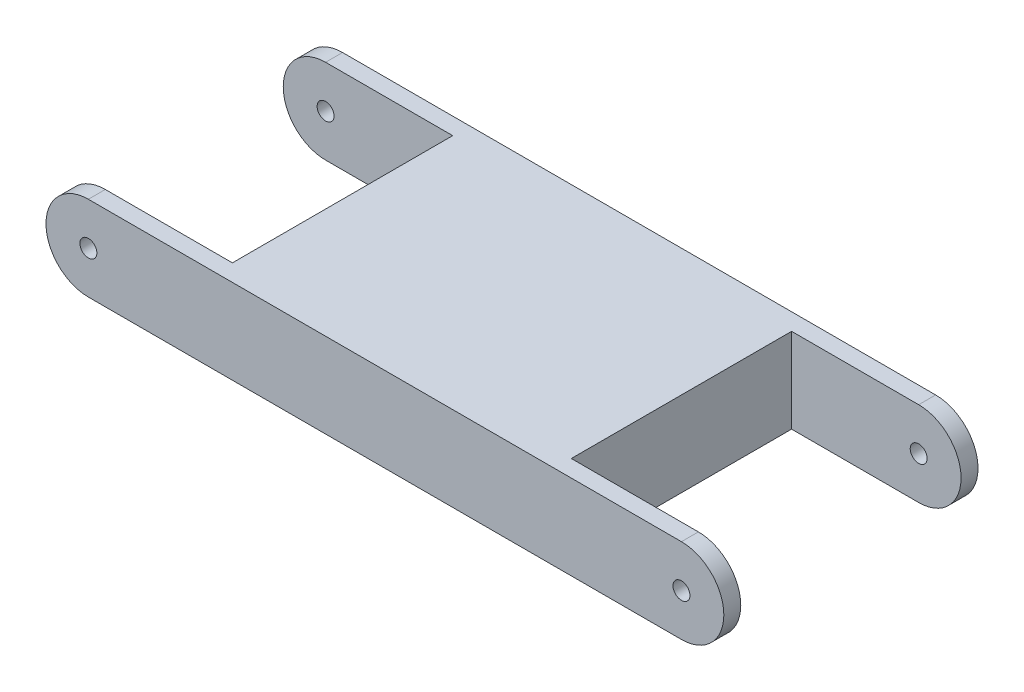
ISO-10303-21;
HEADER;
FILE_DESCRIPTION(('STEP AP214'),'2;1');
FILE_NAME('part.step','',(''),(''),'','','');
FILE_SCHEMA(('AUTOMOTIVE_DESIGN { 1 0 10303 214 1 1 1 1 }'));
ENDSEC;
DATA;
#1=APPLICATION_CONTEXT('core data for automotive mechanical design processes');
#2=APPLICATION_PROTOCOL_DEFINITION('international standard','automotive_design',2000,#1);
#3=PRODUCT_CONTEXT('',#1,'mechanical');
#4=PRODUCT('Part','Part','',(#3));
#5=PRODUCT_RELATED_PRODUCT_CATEGORY('part','',(#4));
#6=PRODUCT_DEFINITION_FORMATION('','',#4);
#7=PRODUCT_DEFINITION_CONTEXT('part definition',#1,'design');
#8=PRODUCT_DEFINITION('design','',#6,#7);
#9=PRODUCT_DEFINITION_SHAPE('','',#8);
#10=(LENGTH_UNIT() NAMED_UNIT(*) SI_UNIT(.MILLI.,.METRE.));
#11=(NAMED_UNIT(*) PLANE_ANGLE_UNIT() SI_UNIT($,.RADIAN.));
#12=(NAMED_UNIT(*) SI_UNIT($,.STERADIAN.) SOLID_ANGLE_UNIT());
#13=UNCERTAINTY_MEASURE_WITH_UNIT(LENGTH_MEASURE(1.E-05),#10,'distance_accuracy_value','');
#14=(GEOMETRIC_REPRESENTATION_CONTEXT(3) GLOBAL_UNCERTAINTY_ASSIGNED_CONTEXT((#13)) GLOBAL_UNIT_ASSIGNED_CONTEXT((#10,
#11,#12)) REPRESENTATION_CONTEXT('',''));
#15=CARTESIAN_POINT('',(0.,0.,0.));
#16=DIRECTION('',(0.,0.,1.));
#17=DIRECTION('',(1.,0.,0.));
#18=AXIS2_PLACEMENT_3D('',#15,#16,#17);
#19=CARTESIAN_POINT('',(-35.,-5.,30.));
#20=DIRECTION('',(0.,1.,0.));
#21=DIRECTION('',(0.,0.,1.));
#22=AXIS2_PLACEMENT_3D('',#19,#20,#21);
#23=PLANE('',#22);
#24=DIRECTION('',(1.,0.,0.));
#25=VECTOR('',#24,1.);
#26=CARTESIAN_POINT('',(-35.,-5.,2.));
#27=LINE('',#26,#25);
#28=CARTESIAN_POINT('',(20.,-5.,2.));
#29=VERTEX_POINT('',#28);
#30=CARTESIAN_POINT('',(35.,-5.,2.));
#31=VERTEX_POINT('',#30);
#32=EDGE_CURVE('E154',#29,#31,#27,.T.);
#33=ORIENTED_EDGE('',*,*,#32,.F.);
#34=DIRECTION('',(0.,0.,-1.));
#35=VECTOR('',#34,1.);
#36=CARTESIAN_POINT('',(20.,-5.,30.));
#37=LINE('',#36,#35);
#38=CARTESIAN_POINT('',(20.,-5.,28.));
#39=VERTEX_POINT('',#38);
#40=EDGE_CURVE('E156',#39,#29,#37,.T.);
#41=ORIENTED_EDGE('',*,*,#40,.F.);
#42=DIRECTION('',(-1.,0.,0.));
#43=VECTOR('',#42,1.);
#44=CARTESIAN_POINT('',(-35.,-5.,28.));
#45=LINE('',#44,#43);
#46=CARTESIAN_POINT('',(35.,-5.,28.));
#47=VERTEX_POINT('',#46);
#48=EDGE_CURVE('E138',#47,#39,#45,.T.);
#49=ORIENTED_EDGE('',*,*,#48,.F.);
#50=DIRECTION('',(0.,0.,-1.));
#51=VECTOR('',#50,1.);
#52=CARTESIAN_POINT('',(35.,-5.,30.));
#53=LINE('',#52,#51);
#54=CARTESIAN_POINT('',(35.,-5.,30.));
#55=VERTEX_POINT('',#54);
#56=EDGE_CURVE('E214',#55,#47,#53,.T.);
#57=ORIENTED_EDGE('',*,*,#56,.F.);
#58=DIRECTION('',(1.,0.,0.));
#59=VECTOR('',#58,1.);
#60=CARTESIAN_POINT('',(-35.,-5.,30.));
#61=LINE('',#60,#59);
#62=CARTESIAN_POINT('',(-35.,-5.,30.));
#63=VERTEX_POINT('',#62);
#64=EDGE_CURVE('E189',#63,#55,#61,.T.);
#65=ORIENTED_EDGE('',*,*,#64,.F.);
#66=DIRECTION('',(0.,0.,-1.));
#67=VECTOR('',#66,1.);
#68=CARTESIAN_POINT('',(-35.,-5.,30.));
#69=LINE('',#68,#67);
#70=CARTESIAN_POINT('',(-35.,-5.,28.));
#71=VERTEX_POINT('',#70);
#72=EDGE_CURVE('E217',#63,#71,#69,.T.);
#73=ORIENTED_EDGE('',*,*,#72,.T.);
#74=DIRECTION('',(-1.,0.,0.));
#75=VECTOR('',#74,1.);
#76=CARTESIAN_POINT('',(-35.,-5.,28.));
#77=LINE('',#76,#75);
#78=CARTESIAN_POINT('',(-20.,-5.,28.));
#79=VERTEX_POINT('',#78);
#80=EDGE_CURVE('E174',#79,#71,#77,.T.);
#81=ORIENTED_EDGE('',*,*,#80,.F.);
#82=DIRECTION('',(0.,0.,1.));
#83=VECTOR('',#82,1.);
#84=CARTESIAN_POINT('',(-20.,-5.,30.));
#85=LINE('',#84,#83);
#86=CARTESIAN_POINT('',(-20.,-5.,2.));
#87=VERTEX_POINT('',#86);
#88=EDGE_CURVE('E176',#87,#79,#85,.T.);
#89=ORIENTED_EDGE('',*,*,#88,.F.);
#90=DIRECTION('',(1.,0.,0.));
#91=VECTOR('',#90,1.);
#92=CARTESIAN_POINT('',(-35.,-5.,2.));
#93=LINE('',#92,#91);
#94=CARTESIAN_POINT('',(-35.,-5.,2.));
#95=VERTEX_POINT('',#94);
#96=EDGE_CURVE('E167',#95,#87,#93,.T.);
#97=ORIENTED_EDGE('',*,*,#96,.F.);
#98=CARTESIAN_POINT('',(-35.,-5.,0.));
#99=VERTEX_POINT('',#98);
#100=EDGE_CURVE('E216',#95,#99,#69,.T.);
#101=ORIENTED_EDGE('',*,*,#100,.T.);
#102=DIRECTION('',(1.,0.,0.));
#103=VECTOR('',#102,1.);
#104=CARTESIAN_POINT('',(-35.,-5.,0.));
#105=LINE('',#104,#103);
#106=CARTESIAN_POINT('',(35.,-5.,0.));
#107=VERTEX_POINT('',#106);
#108=EDGE_CURVE('E200',#99,#107,#105,.T.);
#109=ORIENTED_EDGE('',*,*,#108,.T.);
#110=EDGE_CURVE('E213',#31,#107,#53,.T.);
#111=ORIENTED_EDGE('',*,*,#110,.F.);
#112=EDGE_LOOP('',(#33,#41,#49,#57,#65,#73,#81,#89,#97,#101,#109,#111));
#113=FACE_BOUND('',#112,.T.);
#114=ADVANCED_FACE('F33',(#113),#23,.F.);
#115=CARTESIAN_POINT('',(-35.,5.,30.));
#116=DIRECTION('',(0.,-1.,0.));
#117=DIRECTION('',(0.,0.,-1.));
#118=AXIS2_PLACEMENT_3D('',#115,#116,#117);
#119=PLANE('',#118);
#120=DIRECTION('',(-1.,0.,0.));
#121=VECTOR('',#120,1.);
#122=CARTESIAN_POINT('',(-35.,5.,2.));
#123=LINE('',#122,#121);
#124=CARTESIAN_POINT('',(35.,5.,2.));
#125=VERTEX_POINT('',#124);
#126=CARTESIAN_POINT('',(20.,5.,2.));
#127=VERTEX_POINT('',#126);
#128=EDGE_CURVE('E152',#125,#127,#123,.T.);
#129=ORIENTED_EDGE('',*,*,#128,.F.);
#130=DIRECTION('',(0.,0.,-1.));
#131=VECTOR('',#130,1.);
#132=CARTESIAN_POINT('',(35.,5.,30.));
#133=LINE('',#132,#131);
#134=CARTESIAN_POINT('',(35.,5.,0.));
#135=VERTEX_POINT('',#134);
#136=EDGE_CURVE('E211',#125,#135,#133,.T.);
#137=ORIENTED_EDGE('',*,*,#136,.T.);
#138=DIRECTION('',(-1.,0.,0.));
#139=VECTOR('',#138,1.);
#140=CARTESIAN_POINT('',(-35.,5.,0.));
#141=LINE('',#140,#139);
#142=CARTESIAN_POINT('',(-35.,5.,0.));
#143=VERTEX_POINT('',#142);
#144=EDGE_CURVE('E190',#135,#143,#141,.T.);
#145=ORIENTED_EDGE('',*,*,#144,.T.);
#146=DIRECTION('',(0.,0.,-1.));
#147=VECTOR('',#146,1.);
#148=CARTESIAN_POINT('',(-35.,5.,30.));
#149=LINE('',#148,#147);
#150=CARTESIAN_POINT('',(-35.,5.,2.));
#151=VERTEX_POINT('',#150);
#152=EDGE_CURVE('E196',#151,#143,#149,.T.);
#153=ORIENTED_EDGE('',*,*,#152,.F.);
#154=DIRECTION('',(-1.,0.,0.));
#155=VECTOR('',#154,1.);
#156=CARTESIAN_POINT('',(-35.,5.,2.));
#157=LINE('',#156,#155);
#158=CARTESIAN_POINT('',(-20.,5.,2.));
#159=VERTEX_POINT('',#158);
#160=EDGE_CURVE('E163',#159,#151,#157,.T.);
#161=ORIENTED_EDGE('',*,*,#160,.F.);
#162=DIRECTION('',(0.,0.,-1.));
#163=VECTOR('',#162,1.);
#164=CARTESIAN_POINT('',(-20.,5.,30.));
#165=LINE('',#164,#163);
#166=CARTESIAN_POINT('',(-20.,5.,28.));
#167=VERTEX_POINT('',#166);
#168=EDGE_CURVE('E41',#167,#159,#165,.T.);
#169=ORIENTED_EDGE('',*,*,#168,.F.);
#170=DIRECTION('',(1.,0.,0.));
#171=VECTOR('',#170,1.);
#172=CARTESIAN_POINT('',(-35.,5.,28.));
#173=LINE('',#172,#171);
#174=CARTESIAN_POINT('',(-35.,5.,28.));
#175=VERTEX_POINT('',#174);
#176=EDGE_CURVE('E170',#175,#167,#173,.T.);
#177=ORIENTED_EDGE('',*,*,#176,.F.);
#178=CARTESIAN_POINT('',(-35.,5.,30.));
#179=VERTEX_POINT('',#178);
#180=EDGE_CURVE('E208',#179,#175,#149,.T.);
#181=ORIENTED_EDGE('',*,*,#180,.F.);
#182=DIRECTION('',(-1.,0.,0.));
#183=VECTOR('',#182,1.);
#184=CARTESIAN_POINT('',(-35.,5.,30.));
#185=LINE('',#184,#183);
#186=CARTESIAN_POINT('',(35.,5.,30.));
#187=VERTEX_POINT('',#186);
#188=EDGE_CURVE('E194',#187,#179,#185,.T.);
#189=ORIENTED_EDGE('',*,*,#188,.F.);
#190=CARTESIAN_POINT('',(35.,5.,28.));
#191=VERTEX_POINT('',#190);
#192=EDGE_CURVE('E142',#187,#191,#133,.T.);
#193=ORIENTED_EDGE('',*,*,#192,.T.);
#194=DIRECTION('',(1.,0.,0.));
#195=VECTOR('',#194,1.);
#196=CARTESIAN_POINT('',(-35.,5.,28.));
#197=LINE('',#196,#195);
#198=CARTESIAN_POINT('',(20.,5.,28.));
#199=VERTEX_POINT('',#198);
#200=EDGE_CURVE('E135',#199,#191,#197,.T.);
#201=ORIENTED_EDGE('',*,*,#200,.F.);
#202=DIRECTION('',(0.,0.,1.));
#203=VECTOR('',#202,1.);
#204=CARTESIAN_POINT('',(20.,5.,30.));
#205=LINE('',#204,#203);
#206=EDGE_CURVE('E11',#127,#199,#205,.T.);
#207=ORIENTED_EDGE('',*,*,#206,.F.);
#208=EDGE_LOOP('',(#129,#137,#145,#153,#161,#169,#177,#181,#189,#193,#201,#207));
#209=FACE_BOUND('',#208,.T.);
#210=ADVANCED_FACE('F140',(#209),#119,.F.);
#211=CARTESIAN_POINT('',(35.,0.,30.));
#212=DIRECTION('',(0.,0.,-1.));
#213=DIRECTION('',(-1.,0.,0.));
#214=AXIS2_PLACEMENT_3D('',#211,#212,#213);
#215=CYLINDRICAL_SURFACE('',#214,5.);
#216=ORIENTED_EDGE('',*,*,#136,.F.);
#217=CARTESIAN_POINT('',(35.,0.,2.));
#218=DIRECTION('',(0.,0.,1.));
#219=DIRECTION('',(1.,0.,0.));
#220=AXIS2_PLACEMENT_3D('',#217,#218,#219);
#221=CIRCLE('',#220,5.);
#222=EDGE_CURVE('E150',#31,#125,#221,.T.);
#223=ORIENTED_EDGE('',*,*,#222,.F.);
#224=ORIENTED_EDGE('',*,*,#110,.T.);
#225=CARTESIAN_POINT('',(35.,0.,0.));
#226=DIRECTION('',(0.,0.,1.));
#227=DIRECTION('',(1.,0.,0.));
#228=AXIS2_PLACEMENT_3D('',#225,#226,#227);
#229=CIRCLE('',#228,5.);
#230=EDGE_CURVE('E203',#107,#135,#229,.T.);
#231=ORIENTED_EDGE('',*,*,#230,.T.);
#232=EDGE_LOOP('',(#216,#223,#224,#231));
#233=FACE_BOUND('',#232,.T.);
#234=ADVANCED_FACE('F245',(#233),#215,.T.);
#235=CARTESIAN_POINT('',(35.,0.,28.));
#236=DIRECTION('',(0.,0.,-1.));
#237=DIRECTION('',(-1.,0.,0.));
#238=AXIS2_PLACEMENT_3D('',#235,#236,#237);
#239=CIRCLE('',#238,5.);
#240=EDGE_CURVE('E48',#191,#47,#239,.T.);
#241=ORIENTED_EDGE('',*,*,#240,.F.);
#242=ORIENTED_EDGE('',*,*,#192,.F.);
#243=CARTESIAN_POINT('',(35.,0.,30.));
#244=DIRECTION('',(0.,0.,1.));
#245=DIRECTION('',(1.,0.,0.));
#246=AXIS2_PLACEMENT_3D('',#243,#244,#245);
#247=CIRCLE('',#246,5.);
#248=EDGE_CURVE('E192',#55,#187,#247,.T.);
#249=ORIENTED_EDGE('',*,*,#248,.F.);
#250=ORIENTED_EDGE('',*,*,#56,.T.);
#251=EDGE_LOOP('',(#241,#242,#249,#250));
#252=FACE_BOUND('',#251,.T.);
#253=ADVANCED_FACE('F282',(#252),#215,.T.);
#254=CARTESIAN_POINT('',(35.,0.,30.));
#255=DIRECTION('',(0.,0.,-1.));
#256=DIRECTION('',(-1.,0.,0.));
#257=AXIS2_PLACEMENT_3D('',#254,#255,#256);
#258=CYLINDRICAL_SURFACE('',#257,0.999999999999998);
#259=CARTESIAN_POINT('',(35.,0.,0.));
#260=DIRECTION('',(0.,0.,1.));
#261=DIRECTION('',(1.,0.,0.));
#262=AXIS2_PLACEMENT_3D('',#259,#260,#261);
#263=CIRCLE('',#262,0.999999999999998);
#264=CARTESIAN_POINT('',(36.,0.,0.));
#265=VERTEX_POINT('',#264);
#266=EDGE_CURVE('E181',#265,#265,#263,.F.);
#267=ORIENTED_EDGE('',*,*,#266,.T.);
#268=EDGE_LOOP('',(#267));
#269=FACE_BOUND('',#268,.T.);
#270=CARTESIAN_POINT('',(35.,0.,2.));
#271=DIRECTION('',(0.,0.,1.));
#272=DIRECTION('',(1.,0.,0.));
#273=AXIS2_PLACEMENT_3D('',#270,#271,#272);
#274=CIRCLE('',#273,0.999999999999998);
#275=CARTESIAN_POINT('',(36.,0.,2.));
#276=VERTEX_POINT('',#275);
#277=EDGE_CURVE('E144',#276,#276,#274,.T.);
#278=ORIENTED_EDGE('',*,*,#277,.T.);
#279=EDGE_LOOP('',(#278));
#280=FACE_BOUND('',#279,.T.);
#281=ADVANCED_FACE('F233',(#269,#280),#258,.F.);
#282=CARTESIAN_POINT('',(35.,0.,30.));
#283=DIRECTION('',(0.,0.,1.));
#284=DIRECTION('',(-1.,0.,0.));
#285=AXIS2_PLACEMENT_3D('',#282,#283,#284);
#286=CIRCLE('',#285,0.999999999999998);
#287=CARTESIAN_POINT('',(34.,0.,30.));
#288=VERTEX_POINT('',#287);
#289=EDGE_CURVE('E178',#288,#288,#286,.T.);
#290=ORIENTED_EDGE('',*,*,#289,.T.);
#291=EDGE_LOOP('',(#290));
#292=FACE_BOUND('',#291,.T.);
#293=CARTESIAN_POINT('',(35.,0.,28.));
#294=DIRECTION('',(0.,0.,-1.));
#295=DIRECTION('',(-1.,0.,0.));
#296=AXIS2_PLACEMENT_3D('',#293,#294,#295);
#297=CIRCLE('',#296,0.999999999999998);
#298=CARTESIAN_POINT('',(34.,0.,28.));
#299=VERTEX_POINT('',#298);
#300=EDGE_CURVE('E146',#299,#299,#297,.T.);
#301=ORIENTED_EDGE('',*,*,#300,.T.);
#302=EDGE_LOOP('',(#301));
#303=FACE_BOUND('',#302,.T.);
#304=ADVANCED_FACE('F297',(#292,#303),#258,.F.);
#305=CARTESIAN_POINT('',(-35.,0.,30.));
#306=DIRECTION('',(0.,0.,-1.));
#307=DIRECTION('',(-1.,0.,0.));
#308=AXIS2_PLACEMENT_3D('',#305,#306,#307);
#309=CYLINDRICAL_SURFACE('',#308,5.);
#310=ORIENTED_EDGE('',*,*,#180,.T.);
#311=CARTESIAN_POINT('',(-35.,0.,28.));
#312=DIRECTION('',(0.,0.,-1.));
#313=DIRECTION('',(-1.,0.,0.));
#314=AXIS2_PLACEMENT_3D('',#311,#312,#313);
#315=CIRCLE('',#314,5.);
#316=EDGE_CURVE('E172',#71,#175,#315,.T.);
#317=ORIENTED_EDGE('',*,*,#316,.F.);
#318=ORIENTED_EDGE('',*,*,#72,.F.);
#319=CARTESIAN_POINT('',(-35.,0.,30.));
#320=DIRECTION('',(0.,0.,1.));
#321=DIRECTION('',(1.,0.,0.));
#322=AXIS2_PLACEMENT_3D('',#319,#320,#321);
#323=CIRCLE('',#322,5.);
#324=EDGE_CURVE('E186',#179,#63,#323,.T.);
#325=ORIENTED_EDGE('',*,*,#324,.F.);
#326=EDGE_LOOP('',(#310,#317,#318,#325));
#327=FACE_BOUND('',#326,.T.);
#328=ADVANCED_FACE('F35',(#327),#309,.T.);
#329=CARTESIAN_POINT('',(-35.,0.,2.));
#330=DIRECTION('',(0.,0.,1.));
#331=DIRECTION('',(1.,0.,0.));
#332=AXIS2_PLACEMENT_3D('',#329,#330,#331);
#333=CIRCLE('',#332,5.);
#334=EDGE_CURVE('E165',#151,#95,#333,.T.);
#335=ORIENTED_EDGE('',*,*,#334,.F.);
#336=ORIENTED_EDGE('',*,*,#152,.T.);
#337=CARTESIAN_POINT('',(-35.,0.,0.));
#338=DIRECTION('',(0.,0.,1.));
#339=DIRECTION('',(1.,0.,0.));
#340=AXIS2_PLACEMENT_3D('',#337,#338,#339);
#341=CIRCLE('',#340,5.);
#342=EDGE_CURVE('E197',#143,#99,#341,.T.);
#343=ORIENTED_EDGE('',*,*,#342,.T.);
#344=ORIENTED_EDGE('',*,*,#100,.F.);
#345=EDGE_LOOP('',(#335,#336,#343,#344));
#346=FACE_BOUND('',#345,.T.);
#347=ADVANCED_FACE('F259',(#346),#309,.T.);
#348=CARTESIAN_POINT('',(-35.,0.,30.));
#349=DIRECTION('',(0.,0.,-1.));
#350=DIRECTION('',(-1.,0.,0.));
#351=AXIS2_PLACEMENT_3D('',#348,#349,#350);
#352=CYLINDRICAL_SURFACE('',#351,0.999999999999998);
#353=CARTESIAN_POINT('',(-35.,0.,30.));
#354=DIRECTION('',(0.,0.,1.));
#355=DIRECTION('',(1.,0.,0.));
#356=AXIS2_PLACEMENT_3D('',#353,#354,#355);
#357=CIRCLE('',#356,0.999999999999998);
#358=CARTESIAN_POINT('',(-34.,0.,30.));
#359=VERTEX_POINT('',#358);
#360=EDGE_CURVE('E182',#359,#359,#357,.T.);
#361=ORIENTED_EDGE('',*,*,#360,.T.);
#362=EDGE_LOOP('',(#361));
#363=FACE_BOUND('',#362,.T.);
#364=CARTESIAN_POINT('',(-35.,0.,28.));
#365=DIRECTION('',(0.,0.,-1.));
#366=DIRECTION('',(-1.,0.,0.));
#367=AXIS2_PLACEMENT_3D('',#364,#365,#366);
#368=CIRCLE('',#367,0.999999999999998);
#369=CARTESIAN_POINT('',(-36.,0.,28.));
#370=VERTEX_POINT('',#369);
#371=EDGE_CURVE('E169',#370,#370,#368,.T.);
#372=ORIENTED_EDGE('',*,*,#371,.T.);
#373=EDGE_LOOP('',(#372));
#374=FACE_BOUND('',#373,.T.);
#375=ADVANCED_FACE('F292',(#363,#374),#352,.F.);
#376=CARTESIAN_POINT('',(-35.,0.,0.));
#377=DIRECTION('',(0.,0.,1.));
#378=DIRECTION('',(1.,0.,0.));
#379=AXIS2_PLACEMENT_3D('',#376,#377,#378);
#380=CIRCLE('',#379,0.999999999999998);
#381=CARTESIAN_POINT('',(-34.,0.,0.));
#382=VERTEX_POINT('',#381);
#383=EDGE_CURVE('E185',#382,#382,#380,.F.);
#384=ORIENTED_EDGE('',*,*,#383,.T.);
#385=EDGE_LOOP('',(#384));
#386=FACE_BOUND('',#385,.T.);
#387=CARTESIAN_POINT('',(-35.,0.,2.));
#388=DIRECTION('',(0.,0.,1.));
#389=DIRECTION('',(1.,0.,0.));
#390=AXIS2_PLACEMENT_3D('',#387,#388,#389);
#391=CIRCLE('',#390,0.999999999999998);
#392=CARTESIAN_POINT('',(-34.,0.,2.));
#393=VERTEX_POINT('',#392);
#394=EDGE_CURVE('E162',#393,#393,#391,.T.);
#395=ORIENTED_EDGE('',*,*,#394,.T.);
#396=EDGE_LOOP('',(#395));
#397=FACE_BOUND('',#396,.T.);
#398=ADVANCED_FACE('F290',(#386,#397),#352,.F.);
#399=CARTESIAN_POINT('',(-35.,0.,30.));
#400=DIRECTION('',(0.,0.,1.));
#401=DIRECTION('',(1.,0.,0.));
#402=AXIS2_PLACEMENT_3D('',#399,#400,#401);
#403=PLANE('',#402);
#404=ORIENTED_EDGE('',*,*,#360,.F.);
#405=EDGE_LOOP('',(#404));
#406=FACE_BOUND('',#405,.T.);
#407=ORIENTED_EDGE('',*,*,#324,.T.);
#408=ORIENTED_EDGE('',*,*,#64,.T.);
#409=ORIENTED_EDGE('',*,*,#248,.T.);
#410=ORIENTED_EDGE('',*,*,#188,.T.);
#411=EDGE_LOOP('',(#407,#408,#409,#410));
#412=FACE_BOUND('',#411,.T.);
#413=ORIENTED_EDGE('',*,*,#289,.F.);
#414=EDGE_LOOP('',(#413));
#415=FACE_BOUND('',#414,.T.);
#416=ADVANCED_FACE('F286',(#406,#412,#415),#403,.T.);
#417=CARTESIAN_POINT('',(-35.,0.,0.));
#418=DIRECTION('',(0.,0.,1.));
#419=DIRECTION('',(1.,0.,0.));
#420=AXIS2_PLACEMENT_3D('',#417,#418,#419);
#421=PLANE('',#420);
#422=ORIENTED_EDGE('',*,*,#383,.F.);
#423=EDGE_LOOP('',(#422));
#424=FACE_BOUND('',#423,.T.);
#425=ORIENTED_EDGE('',*,*,#342,.F.);
#426=ORIENTED_EDGE('',*,*,#144,.F.);
#427=ORIENTED_EDGE('',*,*,#230,.F.);
#428=ORIENTED_EDGE('',*,*,#108,.F.);
#429=EDGE_LOOP('',(#425,#426,#427,#428));
#430=FACE_BOUND('',#429,.T.);
#431=ORIENTED_EDGE('',*,*,#266,.F.);
#432=EDGE_LOOP('',(#431));
#433=FACE_BOUND('',#432,.T.);
#434=ADVANCED_FACE('F253',(#424,#430,#433),#421,.F.);
#435=CARTESIAN_POINT('',(-20.,30.,2.));
#436=DIRECTION('',(-1.,0.,0.));
#437=DIRECTION('',(0.,0.,1.));
#438=AXIS2_PLACEMENT_3D('',#435,#436,#437);
#439=PLANE('',#438);
#440=ORIENTED_EDGE('',*,*,#88,.T.);
#441=DIRECTION('',(0.,-1.,0.));
#442=VECTOR('',#441,1.);
#443=CARTESIAN_POINT('',(-20.,30.,28.));
#444=LINE('',#443,#442);
#445=EDGE_CURVE('E159',#167,#79,#444,.T.);
#446=ORIENTED_EDGE('',*,*,#445,.F.);
#447=ORIENTED_EDGE('',*,*,#168,.T.);
#448=DIRECTION('',(0.,-1.,0.));
#449=VECTOR('',#448,1.);
#450=CARTESIAN_POINT('',(-20.,30.,2.));
#451=LINE('',#450,#449);
#452=EDGE_CURVE('E56',#159,#87,#451,.T.);
#453=ORIENTED_EDGE('',*,*,#452,.T.);
#454=EDGE_LOOP('',(#440,#446,#447,#453));
#455=FACE_BOUND('',#454,.T.);
#456=ADVANCED_FACE('F270',(#455),#439,.T.);
#457=CARTESIAN_POINT('',(-40.,30.,28.));
#458=DIRECTION('',(0.,0.,-1.));
#459=DIRECTION('',(-1.,0.,0.));
#460=AXIS2_PLACEMENT_3D('',#457,#458,#459);
#461=PLANE('',#460);
#462=ORIENTED_EDGE('',*,*,#371,.F.);
#463=EDGE_LOOP('',(#462));
#464=FACE_BOUND('',#463,.T.);
#465=ORIENTED_EDGE('',*,*,#80,.T.);
#466=ORIENTED_EDGE('',*,*,#316,.T.);
#467=ORIENTED_EDGE('',*,*,#176,.T.);
#468=ORIENTED_EDGE('',*,*,#445,.T.);
#469=EDGE_LOOP('',(#465,#466,#467,#468));
#470=FACE_BOUND('',#469,.T.);
#471=ADVANCED_FACE('F262',(#464,#470),#461,.T.);
#472=CARTESIAN_POINT('',(-40.,30.,2.));
#473=DIRECTION('',(0.,0.,1.));
#474=DIRECTION('',(1.,0.,0.));
#475=AXIS2_PLACEMENT_3D('',#472,#473,#474);
#476=PLANE('',#475);
#477=ORIENTED_EDGE('',*,*,#394,.F.);
#478=EDGE_LOOP('',(#477));
#479=FACE_BOUND('',#478,.T.);
#480=ORIENTED_EDGE('',*,*,#96,.T.);
#481=ORIENTED_EDGE('',*,*,#452,.F.);
#482=ORIENTED_EDGE('',*,*,#160,.T.);
#483=ORIENTED_EDGE('',*,*,#334,.T.);
#484=EDGE_LOOP('',(#480,#481,#482,#483));
#485=FACE_BOUND('',#484,.T.);
#486=ADVANCED_FACE('F260',(#479,#485),#476,.T.);
#487=CARTESIAN_POINT('',(20.,30.,2.));
#488=DIRECTION('',(1.,0.,0.));
#489=DIRECTION('',(0.,0.,-1.));
#490=AXIS2_PLACEMENT_3D('',#487,#488,#489);
#491=PLANE('',#490);
#492=ORIENTED_EDGE('',*,*,#40,.T.);
#493=DIRECTION('',(0.,-1.,0.));
#494=VECTOR('',#493,1.);
#495=CARTESIAN_POINT('',(20.,30.,2.));
#496=LINE('',#495,#494);
#497=EDGE_CURVE('E129',#127,#29,#496,.T.);
#498=ORIENTED_EDGE('',*,*,#497,.F.);
#499=ORIENTED_EDGE('',*,*,#206,.T.);
#500=DIRECTION('',(0.,-1.,0.));
#501=VECTOR('',#500,1.);
#502=CARTESIAN_POINT('',(20.,30.,28.));
#503=LINE('',#502,#501);
#504=EDGE_CURVE('E126',#199,#39,#503,.T.);
#505=ORIENTED_EDGE('',*,*,#504,.T.);
#506=EDGE_LOOP('',(#492,#498,#499,#505));
#507=FACE_BOUND('',#506,.T.);
#508=ADVANCED_FACE('F125',(#507),#491,.T.);
#509=CARTESIAN_POINT('',(40.,30.,2.));
#510=DIRECTION('',(0.,0.,1.));
#511=DIRECTION('',(1.,0.,0.));
#512=AXIS2_PLACEMENT_3D('',#509,#510,#511);
#513=PLANE('',#512);
#514=ORIENTED_EDGE('',*,*,#277,.F.);
#515=EDGE_LOOP('',(#514));
#516=FACE_BOUND('',#515,.T.);
#517=ORIENTED_EDGE('',*,*,#32,.T.);
#518=ORIENTED_EDGE('',*,*,#222,.T.);
#519=ORIENTED_EDGE('',*,*,#128,.T.);
#520=ORIENTED_EDGE('',*,*,#497,.T.);
#521=EDGE_LOOP('',(#517,#518,#519,#520));
#522=FACE_BOUND('',#521,.T.);
#523=ADVANCED_FACE('F235',(#516,#522),#513,.T.);
#524=CARTESIAN_POINT('',(40.,30.,28.));
#525=DIRECTION('',(0.,0.,-1.));
#526=DIRECTION('',(-1.,0.,0.));
#527=AXIS2_PLACEMENT_3D('',#524,#525,#526);
#528=PLANE('',#527);
#529=ORIENTED_EDGE('',*,*,#300,.F.);
#530=EDGE_LOOP('',(#529));
#531=FACE_BOUND('',#530,.T.);
#532=ORIENTED_EDGE('',*,*,#48,.T.);
#533=ORIENTED_EDGE('',*,*,#504,.F.);
#534=ORIENTED_EDGE('',*,*,#200,.T.);
#535=ORIENTED_EDGE('',*,*,#240,.T.);
#536=EDGE_LOOP('',(#532,#533,#534,#535));
#537=FACE_BOUND('',#536,.T.);
#538=ADVANCED_FACE('F134',(#531,#537),#528,.T.);
#539=CLOSED_SHELL('',(#114,#210,#234,#253,#281,#304,#328,#347,#375,#398,#416,#434,#456,#471,
#486,#508,#523,#538));
#540=MANIFOLD_SOLID_BREP('B2',#539);
#541=ADVANCED_BREP_SHAPE_REPRESENTATION('',(#18,#540),#14);
#542=SHAPE_DEFINITION_REPRESENTATION(#9,#541);
ENDSEC;
END-ISO-10303-21;
